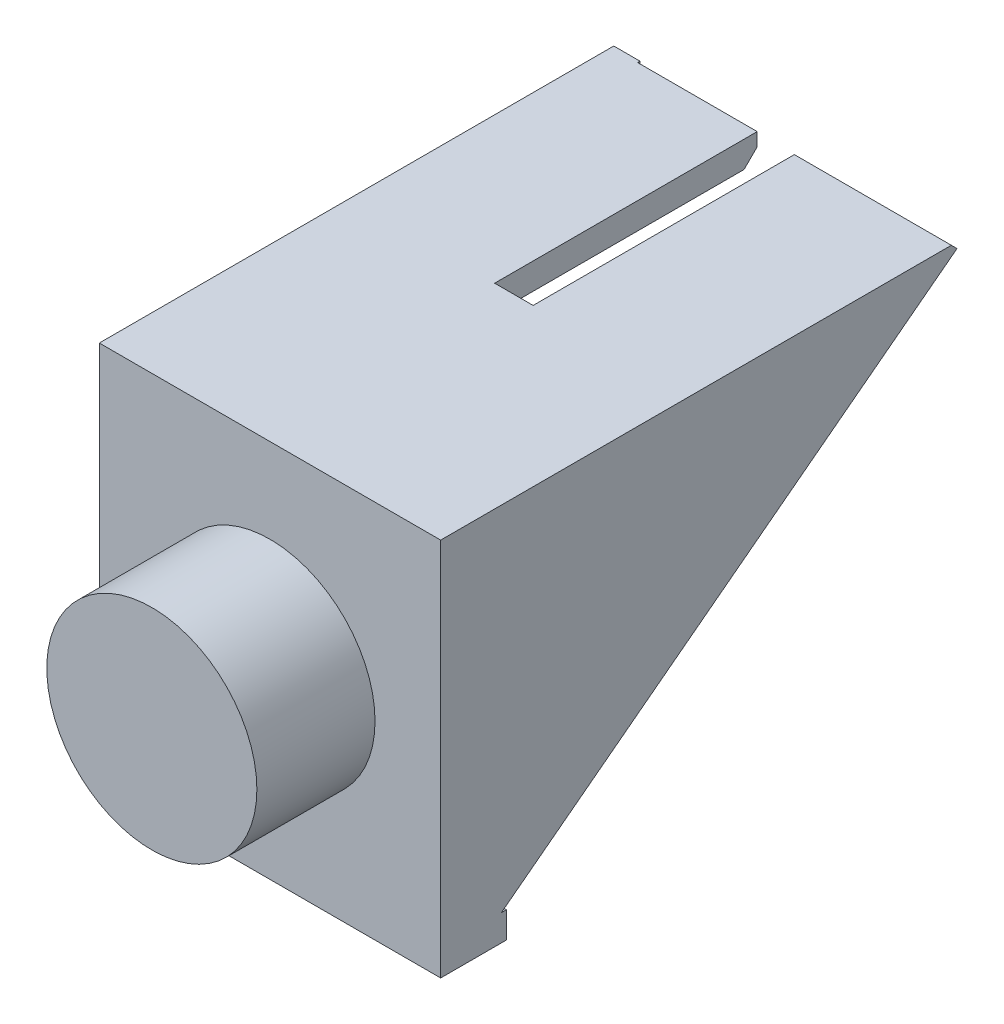
ISO-10303-21;
HEADER;
FILE_DESCRIPTION(('STEP AP214'),'2;1');
FILE_NAME('part.step','',(''),(''),'','','');
FILE_SCHEMA(('AUTOMOTIVE_DESIGN { 1 0 10303 214 1 1 1 1 }'));
ENDSEC;
DATA;
#1=APPLICATION_CONTEXT('core data for automotive mechanical design processes');
#2=APPLICATION_PROTOCOL_DEFINITION('international standard','automotive_design',2000,#1);
#3=PRODUCT_CONTEXT('',#1,'mechanical');
#4=PRODUCT('Part','Part','',(#3));
#5=PRODUCT_RELATED_PRODUCT_CATEGORY('part','',(#4));
#6=PRODUCT_DEFINITION_FORMATION('','',#4);
#7=PRODUCT_DEFINITION_CONTEXT('part definition',#1,'design');
#8=PRODUCT_DEFINITION('design','',#6,#7);
#9=PRODUCT_DEFINITION_SHAPE('','',#8);
#10=(LENGTH_UNIT() NAMED_UNIT(*) SI_UNIT(.MILLI.,.METRE.));
#11=(NAMED_UNIT(*) PLANE_ANGLE_UNIT() SI_UNIT($,.RADIAN.));
#12=(NAMED_UNIT(*) SI_UNIT($,.STERADIAN.) SOLID_ANGLE_UNIT());
#13=UNCERTAINTY_MEASURE_WITH_UNIT(LENGTH_MEASURE(1.E-05),#10,'distance_accuracy_value','');
#14=(GEOMETRIC_REPRESENTATION_CONTEXT(3) GLOBAL_UNCERTAINTY_ASSIGNED_CONTEXT((#13)) GLOBAL_UNIT_ASSIGNED_CONTEXT((#10,
#11,#12)) REPRESENTATION_CONTEXT('',''));
#15=CARTESIAN_POINT('',(0.,0.,0.));
#16=DIRECTION('',(0.,0.,1.));
#17=DIRECTION('',(1.,0.,0.));
#18=AXIS2_PLACEMENT_3D('',#15,#16,#17);
#19=CARTESIAN_POINT('',(0.,0.,-17.));
#20=DIRECTION('',(0.,0.,1.));
#21=DIRECTION('',(1.,0.,0.));
#22=AXIS2_PLACEMENT_3D('',#19,#20,#21);
#23=PLANE('',#22);
#24=DIRECTION('',(0.,1.,0.));
#25=VECTOR('',#24,1.);
#26=CARTESIAN_POINT('',(12.041243368597,23.6,-17.));
#27=LINE('',#26,#25);
#28=CARTESIAN_POINT('',(12.041243368597,21.6,-17.));
#29=VERTEX_POINT('',#28);
#30=CARTESIAN_POINT('',(12.041243368597,23.6,-17.));
#31=VERTEX_POINT('',#30);
#32=EDGE_CURVE('E219',#29,#31,#27,.T.);
#33=ORIENTED_EDGE('',*,*,#32,.F.);
#34=DIRECTION('',(-1.,0.,0.));
#35=VECTOR('',#34,1.);
#36=CARTESIAN_POINT('',(0.,21.6,-17.));
#37=LINE('',#36,#35);
#38=CARTESIAN_POINT('',(9.10916541804306,21.6,-17.));
#39=VERTEX_POINT('',#38);
#40=EDGE_CURVE('E227',#29,#39,#37,.T.);
#41=ORIENTED_EDGE('',*,*,#40,.T.);
#42=DIRECTION('',(0.,-1.,0.));
#43=VECTOR('',#42,1.);
#44=CARTESIAN_POINT('',(9.10916541804306,23.6,-17.));
#45=LINE('',#44,#43);
#46=CARTESIAN_POINT('',(9.10916541804306,23.6,-17.));
#47=VERTEX_POINT('',#46);
#48=EDGE_CURVE('E243',#47,#39,#45,.T.);
#49=ORIENTED_EDGE('',*,*,#48,.F.);
#50=DIRECTION('',(1.,0.,0.));
#51=VECTOR('',#50,1.);
#52=CARTESIAN_POINT('',(0.,23.6,-17.));
#53=LINE('',#52,#51);
#54=EDGE_CURVE('E235',#47,#31,#53,.T.);
#55=ORIENTED_EDGE('',*,*,#54,.T.);
#56=EDGE_LOOP('',(#33,#41,#49,#55));
#57=FACE_BOUND('',#56,.T.);
#58=ADVANCED_FACE('F45',(#57),#23,.F.);
#59=CARTESIAN_POINT('',(22.,0.,0.));
#60=DIRECTION('',(-1.,0.,0.));
#61=DIRECTION('',(0.,-1.,0.));
#62=AXIS2_PLACEMENT_3D('',#59,#60,#61);
#63=PLANE('',#62);
#64=DIRECTION('',(0.,0.,1.));
#65=VECTOR('',#64,1.);
#66=CARTESIAN_POINT('',(22.,21.6,-17.));
#67=LINE('',#66,#65);
#68=CARTESIAN_POINT('',(22.,21.6,-35.2720852881629));
#69=VERTEX_POINT('',#68);
#70=CARTESIAN_POINT('',(22.,21.6,0.));
#71=VERTEX_POINT('',#70);
#72=EDGE_CURVE('E302',#69,#71,#67,.T.);
#73=ORIENTED_EDGE('',*,*,#72,.F.);
#74=DIRECTION('',(0.,0.606197447126442,-0.795314186405212));
#75=VECTOR('',#74,1.);
#76=CARTESIAN_POINT('',(22.,23.6,-37.8960296487841));
#77=LINE('',#76,#75);
#78=CARTESIAN_POINT('',(22.,-3.28478141343808,-2.62394436062127));
#79=VERTEX_POINT('',#78);
#80=EDGE_CURVE('E345',#79,#69,#77,.T.);
#81=ORIENTED_EDGE('',*,*,#80,.F.);
#82=DIRECTION('',(0.,0.,1.));
#83=VECTOR('',#82,1.);
#84=CARTESIAN_POINT('',(22.0000000000001,-3.28478141343808,0.));
#85=LINE('',#84,#83);
#86=CARTESIAN_POINT('',(22.0000000000001,-3.28478141343808,0.));
#87=VERTEX_POINT('',#86);
#88=EDGE_CURVE('E293',#79,#87,#85,.T.);
#89=ORIENTED_EDGE('',*,*,#88,.T.);
#90=DIRECTION('',(0.,-1.,0.));
#91=VECTOR('',#90,1.);
#92=CARTESIAN_POINT('',(22.0000000000001,-5.28478141343809,0.));
#93=LINE('',#92,#91);
#94=EDGE_CURVE('E341',#71,#87,#93,.T.);
#95=ORIENTED_EDGE('',*,*,#94,.F.);
#96=EDGE_LOOP('',(#73,#81,#89,#95));
#97=FACE_BOUND('',#96,.T.);
#98=ADVANCED_FACE('F478',(#97),#63,.T.);
#99=CARTESIAN_POINT('',(0.,10.2,-13.454047634165));
#100=DIRECTION('',(-1.,0.,0.));
#101=DIRECTION('',(0.,0.,1.));
#102=AXIS2_PLACEMENT_3D('',#99,#100,#101);
#103=PLANE('',#102);
#104=DIRECTION('',(0.,-0.606197447126442,0.795314186405212));
#105=VECTOR('',#104,1.);
#106=CARTESIAN_POINT('',(0.,19.3047005383792,-32.2607162490345));
#107=LINE('',#106,#105);
#108=CARTESIAN_POINT('',(0.,21.6,-35.2720852881629));
#109=VERTEX_POINT('',#108);
#110=CARTESIAN_POINT('',(0.,19.3047005383792,-32.2607162490345));
#111=VERTEX_POINT('',#110);
#112=EDGE_CURVE('E309',#109,#111,#107,.T.);
#113=ORIENTED_EDGE('',*,*,#112,.F.);
#114=DIRECTION('',(0.,0.,1.));
#115=VECTOR('',#114,1.);
#116=CARTESIAN_POINT('',(0.,21.6,-17.));
#117=LINE('',#116,#115);
#118=CARTESIAN_POINT('',(0.,21.6,0.));
#119=VERTEX_POINT('',#118);
#120=EDGE_CURVE('E234',#109,#119,#117,.T.);
#121=ORIENTED_EDGE('',*,*,#120,.T.);
#122=DIRECTION('',(0.,1.,0.));
#123=VECTOR('',#122,1.);
#124=CARTESIAN_POINT('',(0.,23.6,0.));
#125=LINE('',#124,#123);
#126=CARTESIAN_POINT('',(0.,-3.28478141343808,0.));
#127=VERTEX_POINT('',#126);
#128=EDGE_CURVE('E318',#127,#119,#125,.T.);
#129=ORIENTED_EDGE('',*,*,#128,.F.);
#130=DIRECTION('',(0.,0.,1.));
#131=VECTOR('',#130,1.);
#132=CARTESIAN_POINT('',(0.,-3.28478141343808,-13.454047634165));
#133=LINE('',#132,#131);
#134=CARTESIAN_POINT('',(0.,-3.28478141343808,-2.62394436062125));
#135=VERTEX_POINT('',#134);
#136=EDGE_CURVE('E288',#135,#127,#133,.T.);
#137=ORIENTED_EDGE('',*,*,#136,.F.);
#138=DIRECTION('',(0.,-0.606197447126442,0.795314186405212));
#139=VECTOR('',#138,1.);
#140=CARTESIAN_POINT('',(0.,-5.28478141343808,0.));
#141=LINE('',#140,#139);
#142=CARTESIAN_POINT('',(0.,1.98230595362597,-9.53421645747481));
#143=VERTEX_POINT('',#142);
#144=EDGE_CURVE('E315',#143,#135,#141,.T.);
#145=ORIENTED_EDGE('',*,*,#144,.F.);
#146=CARTESIAN_POINT('',(0.,10.2,-13.454047634165));
#147=DIRECTION('',(1.,0.,0.));
#148=DIRECTION('',(0.,0.,1.));
#149=AXIS2_PLACEMENT_3D('',#146,#147,#148);
#150=CIRCLE('',#149,9.10470053837925);
#151=CARTESIAN_POINT('',(0.,19.3047005383792,-13.454047634165));
#152=VERTEX_POINT('',#151);
#153=EDGE_CURVE('E312',#152,#143,#150,.T.);
#154=ORIENTED_EDGE('',*,*,#153,.F.);
#155=DIRECTION('',(0.,0.,1.));
#156=VECTOR('',#155,1.);
#157=CARTESIAN_POINT('',(0.,19.3047005383792,-13.454047634165));
#158=LINE('',#157,#156);
#159=EDGE_CURVE('E308',#111,#152,#158,.T.);
#160=ORIENTED_EDGE('',*,*,#159,.F.);
#161=EDGE_LOOP('',(#113,#121,#129,#137,#145,#154,#160));
#162=FACE_BOUND('',#161,.T.);
#163=ADVANCED_FACE('F452',(#162),#103,.F.);
#164=CARTESIAN_POINT('',(0.,22.9938025528736,-37.1007154623789));
#165=VERTEX_POINT('',#164);
#166=CARTESIAN_POINT('',(0.,22.9170360909848,-37.));
#167=VERTEX_POINT('',#166);
#168=EDGE_CURVE('E306',#165,#167,#107,.T.);
#169=ORIENTED_EDGE('',*,*,#168,.F.);
#170=DIRECTION('',(0.,0.991018379982067,-0.133725728779913));
#171=VECTOR('',#170,1.);
#172=CARTESIAN_POINT('',(0.,23.6,-37.1825143442553));
#173=LINE('',#172,#171);
#174=CARTESIAN_POINT('',(0.,23.6,-37.1825143442553));
#175=VERTEX_POINT('',#174);
#176=EDGE_CURVE('E398',#165,#175,#173,.T.);
#177=ORIENTED_EDGE('',*,*,#176,.T.);
#178=DIRECTION('',(0.,0.,-1.));
#179=VECTOR('',#178,1.);
#180=CARTESIAN_POINT('',(0.,23.6,-37.8960296487841));
#181=LINE('',#180,#179);
#182=CARTESIAN_POINT('',(0.,23.6,-37.));
#183=VERTEX_POINT('',#182);
#184=EDGE_CURVE('E320',#183,#175,#181,.T.);
#185=ORIENTED_EDGE('',*,*,#184,.F.);
#186=DIRECTION('',(0.,1.,0.));
#187=VECTOR('',#186,1.);
#188=CARTESIAN_POINT('',(0.,23.6,-37.));
#189=LINE('',#188,#187);
#190=EDGE_CURVE('E255',#167,#183,#189,.T.);
#191=ORIENTED_EDGE('',*,*,#190,.F.);
#192=EDGE_LOOP('',(#169,#177,#185,#191));
#193=FACE_BOUND('',#192,.T.);
#194=ADVANCED_FACE('F528',(#193),#103,.F.);
#195=CARTESIAN_POINT('',(0.,0.,0.));
#196=DIRECTION('',(0.,0.,1.));
#197=DIRECTION('',(1.,0.,0.));
#198=AXIS2_PLACEMENT_3D('',#195,#196,#197);
#199=PLANE('',#198);
#200=DIRECTION('',(1.,0.,0.));
#201=VECTOR('',#200,1.);
#202=CARTESIAN_POINT('',(24.0000000000001,-3.28478141343808,0.));
#203=LINE('',#202,#201);
#204=EDGE_CURVE('E270',#127,#87,#203,.T.);
#205=ORIENTED_EDGE('',*,*,#204,.F.);
#206=ORIENTED_EDGE('',*,*,#128,.T.);
#207=DIRECTION('',(-1.,0.,0.));
#208=VECTOR('',#207,1.);
#209=CARTESIAN_POINT('',(0.,21.6,0.));
#210=LINE('',#209,#208);
#211=EDGE_CURVE('E296',#71,#119,#210,.T.);
#212=ORIENTED_EDGE('',*,*,#211,.F.);
#213=ORIENTED_EDGE('',*,*,#94,.T.);
#214=EDGE_LOOP('',(#205,#206,#212,#213));
#215=FACE_BOUND('',#214,.T.);
#216=ADVANCED_FACE('F476',(#215),#199,.F.);
#217=DIRECTION('',(0.,-1.,0.));
#218=VECTOR('',#217,1.);
#219=CARTESIAN_POINT('',(22.,23.6,-37.));
#220=LINE('',#219,#218);
#221=CARTESIAN_POINT('',(22.,23.4960296487841,-37.));
#222=VERTEX_POINT('',#221);
#223=CARTESIAN_POINT('',(22.,22.9170360909848,-37.));
#224=VERTEX_POINT('',#223);
#225=EDGE_CURVE('E240',#222,#224,#220,.T.);
#226=ORIENTED_EDGE('',*,*,#225,.F.);
#227=DIRECTION('',(0.,-0.707106781186558,-0.707106781186537));
#228=VECTOR('',#227,1.);
#229=CARTESIAN_POINT('',(22.,30.2480148243917,-30.2480148243926));
#230=LINE('',#229,#228);
#231=CARTESIAN_POINT('',(22.,23.167468843909,-37.3285608048751));
#232=VERTEX_POINT('',#231);
#233=EDGE_CURVE('E50',#222,#232,#230,.T.);
#234=ORIENTED_EDGE('',*,*,#233,.T.);
#235=EDGE_CURVE('E344',#224,#232,#77,.T.);
#236=ORIENTED_EDGE('',*,*,#235,.F.);
#237=EDGE_LOOP('',(#226,#234,#236));
#238=FACE_BOUND('',#237,.T.);
#239=ADVANCED_FACE('F409',(#238),#63,.T.);
#240=CARTESIAN_POINT('',(22.,23.6,-37.8960296487841));
#241=DIRECTION('',(0.,-0.795314186405212,-0.606197447126442));
#242=DIRECTION('',(0.,0.606197447126442,-0.795314186405212));
#243=AXIS2_PLACEMENT_3D('',#240,#241,#242);
#244=PLANE('',#243);
#245=ORIENTED_EDGE('',*,*,#235,.T.);
#246=DIRECTION('',(1.,0.,0.));
#247=VECTOR('',#246,1.);
#248=CARTESIAN_POINT('',(24.,23.167468843909,-37.3285608048751));
#249=LINE('',#248,#247);
#250=CARTESIAN_POINT('',(24.,23.167468843909,-37.3285608048751));
#251=VERTEX_POINT('',#250);
#252=EDGE_CURVE('E400',#232,#251,#249,.T.);
#253=ORIENTED_EDGE('',*,*,#252,.T.);
#254=DIRECTION('',(0.,0.606197447126442,-0.795314186405212));
#255=VECTOR('',#254,1.);
#256=CARTESIAN_POINT('',(24.,23.6,-37.8960296487841));
#257=LINE('',#256,#255);
#258=CARTESIAN_POINT('',(24.0000000000001,-3.28478141343808,-2.62394436062125));
#259=VERTEX_POINT('',#258);
#260=EDGE_CURVE('E336',#259,#251,#257,.T.);
#261=ORIENTED_EDGE('',*,*,#260,.F.);
#262=DIRECTION('',(-1.,0.,0.));
#263=VECTOR('',#262,1.);
#264=CARTESIAN_POINT('',(21.9999999999999,-3.28478141343808,-2.62394436062127));
#265=LINE('',#264,#263);
#266=EDGE_CURVE('E290',#259,#79,#265,.T.);
#267=ORIENTED_EDGE('',*,*,#266,.T.);
#268=ORIENTED_EDGE('',*,*,#80,.T.);
#269=DIRECTION('',(0.,0.606197447126442,-0.795314186405212));
#270=VECTOR('',#269,1.);
#271=CARTESIAN_POINT('',(22.,23.6,-37.8960296487841));
#272=LINE('',#271,#270);
#273=EDGE_CURVE('E239',#69,#224,#272,.T.);
#274=ORIENTED_EDGE('',*,*,#273,.T.);
#275=EDGE_LOOP('',(#245,#253,#261,#267,#268,#274));
#276=FACE_BOUND('',#275,.T.);
#277=ADVANCED_FACE('F413',(#276),#244,.T.);
#278=CARTESIAN_POINT('',(0.,-5.28478141343808,0.));
#279=DIRECTION('',(0.,-0.795314186405212,-0.606197447126443));
#280=DIRECTION('',(0.,0.606197447126443,-0.795314186405212));
#281=AXIS2_PLACEMENT_3D('',#278,#279,#280);
#282=PLANE('',#281);
#283=ORIENTED_EDGE('',*,*,#144,.T.);
#284=DIRECTION('',(-1.,0.,0.));
#285=VECTOR('',#284,1.);
#286=CARTESIAN_POINT('',(0.,-3.28478141343808,-2.62394436062125));
#287=LINE('',#286,#285);
#288=CARTESIAN_POINT('',(-2.,-3.28478141343808,-2.62394436062125));
#289=VERTEX_POINT('',#288);
#290=EDGE_CURVE('E369',#135,#289,#287,.T.);
#291=ORIENTED_EDGE('',*,*,#290,.T.);
#292=DIRECTION('',(0.,-0.606197447126442,0.795314186405212));
#293=VECTOR('',#292,1.);
#294=CARTESIAN_POINT('',(-2.,-5.28478141343808,0.));
#295=LINE('',#294,#293);
#296=CARTESIAN_POINT('',(-2.,1.98230595362597,-9.53421645747481));
#297=VERTEX_POINT('',#296);
#298=EDGE_CURVE('E331',#297,#289,#295,.T.);
#299=ORIENTED_EDGE('',*,*,#298,.F.);
#300=DIRECTION('',(-1.,0.,0.));
#301=VECTOR('',#300,1.);
#302=CARTESIAN_POINT('',(0.,1.98230595362597,-9.53421645747481));
#303=LINE('',#302,#301);
#304=EDGE_CURVE('E334',#143,#297,#303,.T.);
#305=ORIENTED_EDGE('',*,*,#304,.F.);
#306=EDGE_LOOP('',(#283,#291,#299,#305));
#307=FACE_BOUND('',#306,.T.);
#308=ADVANCED_FACE('F447',(#307),#282,.T.);
#309=CARTESIAN_POINT('',(24.,23.6,2.));
#310=DIRECTION('',(0.,-1.,0.));
#311=DIRECTION('',(0.,0.,-1.));
#312=AXIS2_PLACEMENT_3D('',#309,#310,#311);
#313=PLANE('',#312);
#314=ORIENTED_EDGE('',*,*,#184,.T.);
#315=DIRECTION('',(-1.,0.,0.));
#316=VECTOR('',#315,1.);
#317=CARTESIAN_POINT('',(-2.,23.6,-37.1825143442553));
#318=LINE('',#317,#316);
#319=CARTESIAN_POINT('',(-2.,23.6,-37.1825143442553));
#320=VERTEX_POINT('',#319);
#321=EDGE_CURVE('E391',#175,#320,#318,.T.);
#322=ORIENTED_EDGE('',*,*,#321,.T.);
#323=DIRECTION('',(0.,0.,-1.));
#324=VECTOR('',#323,1.);
#325=CARTESIAN_POINT('',(-2.,23.6,2.));
#326=LINE('',#325,#324);
#327=CARTESIAN_POINT('',(-2.,23.6,2.));
#328=VERTEX_POINT('',#327);
#329=EDGE_CURVE('E366',#328,#320,#326,.T.);
#330=ORIENTED_EDGE('',*,*,#329,.F.);
#331=DIRECTION('',(-1.,0.,0.));
#332=VECTOR('',#331,1.);
#333=CARTESIAN_POINT('',(24.,23.6,2.));
#334=LINE('',#333,#332);
#335=CARTESIAN_POINT('',(24.,23.6,2.));
#336=VERTEX_POINT('',#335);
#337=EDGE_CURVE('E348',#336,#328,#334,.T.);
#338=ORIENTED_EDGE('',*,*,#337,.F.);
#339=DIRECTION('',(0.,0.,-1.));
#340=VECTOR('',#339,1.);
#341=CARTESIAN_POINT('',(24.,23.6,2.));
#342=LINE('',#341,#340);
#343=CARTESIAN_POINT('',(24.,23.6,-36.8960296487841));
#344=VERTEX_POINT('',#343);
#345=EDGE_CURVE('E359',#336,#344,#342,.T.);
#346=ORIENTED_EDGE('',*,*,#345,.T.);
#347=DIRECTION('',(-1.,0.,0.));
#348=VECTOR('',#347,1.);
#349=CARTESIAN_POINT('',(22.,23.6,-36.8960296487841));
#350=LINE('',#349,#348);
#351=CARTESIAN_POINT('',(12.041243368597,23.6,-36.8960296487841));
#352=VERTEX_POINT('',#351);
#353=EDGE_CURVE('E389',#344,#352,#350,.T.);
#354=ORIENTED_EDGE('',*,*,#353,.T.);
#355=DIRECTION('',(0.,0.,1.));
#356=VECTOR('',#355,1.);
#357=CARTESIAN_POINT('',(12.041243368597,23.6,-37.));
#358=LINE('',#357,#356);
#359=EDGE_CURVE('E223',#352,#31,#358,.T.);
#360=ORIENTED_EDGE('',*,*,#359,.T.);
#361=ORIENTED_EDGE('',*,*,#54,.F.);
#362=DIRECTION('',(0.,0.,1.));
#363=VECTOR('',#362,1.);
#364=CARTESIAN_POINT('',(9.10916541804306,23.6,-37.));
#365=LINE('',#364,#363);
#366=CARTESIAN_POINT('',(9.10916541804306,23.6,-37.));
#367=VERTEX_POINT('',#366);
#368=EDGE_CURVE('E264',#367,#47,#365,.T.);
#369=ORIENTED_EDGE('',*,*,#368,.F.);
#370=DIRECTION('',(1.,0.,0.));
#371=VECTOR('',#370,1.);
#372=CARTESIAN_POINT('',(0.,23.6,-37.));
#373=LINE('',#372,#371);
#374=EDGE_CURVE('E254',#183,#367,#373,.T.);
#375=ORIENTED_EDGE('',*,*,#374,.F.);
#376=EDGE_LOOP('',(#314,#322,#330,#338,#346,#354,#360,#361,#369,#375));
#377=FACE_BOUND('',#376,.T.);
#378=ADVANCED_FACE('F424',(#377),#313,.F.);
#379=CARTESIAN_POINT('',(-2.,20.4,2.));
#380=DIRECTION('',(1.,0.,0.));
#381=DIRECTION('',(0.,0.,-1.));
#382=AXIS2_PLACEMENT_3D('',#379,#380,#381);
#383=PLANE('',#382);
#384=ORIENTED_EDGE('',*,*,#329,.T.);
#385=DIRECTION('',(0.,-0.991018379982067,0.133725728779913));
#386=VECTOR('',#385,1.);
#387=CARTESIAN_POINT('',(-2.,23.6,-37.1825143442553));
#388=LINE('',#387,#386);
#389=CARTESIAN_POINT('',(-2.,22.9938025528736,-37.1007154623789));
#390=VERTEX_POINT('',#389);
#391=EDGE_CURVE('E394',#320,#390,#388,.T.);
#392=ORIENTED_EDGE('',*,*,#391,.T.);
#393=DIRECTION('',(0.,-0.606197447126442,0.795314186405212));
#394=VECTOR('',#393,1.);
#395=CARTESIAN_POINT('',(-2.,19.3047005383792,-32.2607162490345));
#396=LINE('',#395,#394);
#397=CARTESIAN_POINT('',(-2.,19.3047005383792,-32.2607162490345));
#398=VERTEX_POINT('',#397);
#399=EDGE_CURVE('E305',#390,#398,#396,.T.);
#400=ORIENTED_EDGE('',*,*,#399,.T.);
#401=DIRECTION('',(0.,0.,1.));
#402=VECTOR('',#401,1.);
#403=CARTESIAN_POINT('',(-2.,19.3047005383792,-13.454047634165));
#404=LINE('',#403,#402);
#405=CARTESIAN_POINT('',(-2.,19.3047005383792,-13.454047634165));
#406=VERTEX_POINT('',#405);
#407=EDGE_CURVE('E325',#398,#406,#404,.T.);
#408=ORIENTED_EDGE('',*,*,#407,.T.);
#409=CARTESIAN_POINT('',(-2.,10.2,-13.454047634165));
#410=DIRECTION('',(1.,0.,0.));
#411=DIRECTION('',(0.,0.,1.));
#412=AXIS2_PLACEMENT_3D('',#409,#410,#411);
#413=CIRCLE('',#412,9.10470053837925);
#414=EDGE_CURVE('E328',#406,#297,#413,.T.);
#415=ORIENTED_EDGE('',*,*,#414,.T.);
#416=ORIENTED_EDGE('',*,*,#298,.T.);
#417=DIRECTION('',(0.,0.,1.));
#418=VECTOR('',#417,1.);
#419=CARTESIAN_POINT('',(-2.,-3.28478141343808,-3.));
#420=LINE('',#419,#418);
#421=CARTESIAN_POINT('',(-2.,-3.28478141343808,-3.));
#422=VERTEX_POINT('',#421);
#423=EDGE_CURVE('E286',#422,#289,#420,.T.);
#424=ORIENTED_EDGE('',*,*,#423,.F.);
#425=DIRECTION('',(0.,1.,0.));
#426=VECTOR('',#425,1.);
#427=CARTESIAN_POINT('',(-2.,-5.28478141343808,-3.));
#428=LINE('',#427,#426);
#429=CARTESIAN_POINT('',(-2.,-5.28478141343808,-3.));
#430=VERTEX_POINT('',#429);
#431=EDGE_CURVE('E271',#430,#422,#428,.T.);
#432=ORIENTED_EDGE('',*,*,#431,.F.);
#433=DIRECTION('',(0.,0.,-1.));
#434=VECTOR('',#433,1.);
#435=CARTESIAN_POINT('',(-2.,-5.28478141343808,2.));
#436=LINE('',#435,#434);
#437=CARTESIAN_POINT('',(-2.,-5.28478141343808,2.));
#438=VERTEX_POINT('',#437);
#439=EDGE_CURVE('E364',#438,#430,#436,.T.);
#440=ORIENTED_EDGE('',*,*,#439,.F.);
#441=DIRECTION('',(0.,-1.,0.));
#442=VECTOR('',#441,1.);
#443=CARTESIAN_POINT('',(-2.,23.6,2.));
#444=LINE('',#443,#442);
#445=EDGE_CURVE('E353',#328,#438,#444,.T.);
#446=ORIENTED_EDGE('',*,*,#445,.F.);
#447=EDGE_LOOP('',(#384,#392,#400,#408,#415,#416,#424,#432,#440,#446));
#448=FACE_BOUND('',#447,.T.);
#449=ADVANCED_FACE('F440',(#448),#383,.F.);
#450=CARTESIAN_POINT('',(-2.,-5.28478141343808,2.));
#451=DIRECTION('',(0.,1.,0.));
#452=DIRECTION('',(0.,0.,1.));
#453=AXIS2_PLACEMENT_3D('',#450,#451,#452);
#454=PLANE('',#453);
#455=DIRECTION('',(-1.,0.,0.));
#456=VECTOR('',#455,1.);
#457=CARTESIAN_POINT('',(24.0000000000001,-5.28478141343808,-3.));
#458=LINE('',#457,#456);
#459=CARTESIAN_POINT('',(24.0000000000001,-5.28478141343808,-3.));
#460=VERTEX_POINT('',#459);
#461=EDGE_CURVE('E279',#460,#430,#458,.T.);
#462=ORIENTED_EDGE('',*,*,#461,.F.);
#463=DIRECTION('',(0.,0.,-1.));
#464=VECTOR('',#463,1.);
#465=CARTESIAN_POINT('',(24.,-5.28478141343808,2.));
#466=LINE('',#465,#464);
#467=CARTESIAN_POINT('',(24.,-5.28478141343808,2.));
#468=VERTEX_POINT('',#467);
#469=EDGE_CURVE('E362',#468,#460,#466,.T.);
#470=ORIENTED_EDGE('',*,*,#469,.F.);
#471=DIRECTION('',(1.,0.,0.));
#472=VECTOR('',#471,1.);
#473=CARTESIAN_POINT('',(-2.,-5.28478141343808,2.));
#474=LINE('',#473,#472);
#475=EDGE_CURVE('E355',#438,#468,#474,.T.);
#476=ORIENTED_EDGE('',*,*,#475,.F.);
#477=ORIENTED_EDGE('',*,*,#439,.T.);
#478=EDGE_LOOP('',(#462,#470,#476,#477));
#479=FACE_BOUND('',#478,.T.);
#480=ADVANCED_FACE('F438',(#479),#454,.F.);
#481=CARTESIAN_POINT('',(24.,20.4,2.));
#482=DIRECTION('',(-1.,0.,0.));
#483=DIRECTION('',(0.,-1.,0.));
#484=AXIS2_PLACEMENT_3D('',#481,#482,#483);
#485=PLANE('',#484);
#486=ORIENTED_EDGE('',*,*,#260,.T.);
#487=DIRECTION('',(0.,0.707106781186558,0.707106781186537));
#488=VECTOR('',#487,1.);
#489=CARTESIAN_POINT('',(24.,23.167468843909,-37.3285608048751));
#490=LINE('',#489,#488);
#491=EDGE_CURVE('E403',#251,#344,#490,.T.);
#492=ORIENTED_EDGE('',*,*,#491,.T.);
#493=ORIENTED_EDGE('',*,*,#345,.F.);
#494=DIRECTION('',(0.,1.,0.));
#495=VECTOR('',#494,1.);
#496=CARTESIAN_POINT('',(24.,-5.28478141343808,2.));
#497=LINE('',#496,#495);
#498=EDGE_CURVE('E357',#468,#336,#497,.T.);
#499=ORIENTED_EDGE('',*,*,#498,.F.);
#500=ORIENTED_EDGE('',*,*,#469,.T.);
#501=DIRECTION('',(0.,-1.,0.));
#502=VECTOR('',#501,1.);
#503=CARTESIAN_POINT('',(24.0000000000001,-5.28478141343808,-3.));
#504=LINE('',#503,#502);
#505=CARTESIAN_POINT('',(24.0000000000001,-3.28478141343808,-3.));
#506=VERTEX_POINT('',#505);
#507=EDGE_CURVE('E276',#506,#460,#504,.T.);
#508=ORIENTED_EDGE('',*,*,#507,.F.);
#509=DIRECTION('',(0.,0.,1.));
#510=VECTOR('',#509,1.);
#511=CARTESIAN_POINT('',(24.0000000000001,-3.28478141343808,-3.));
#512=LINE('',#511,#510);
#513=EDGE_CURVE('E282',#506,#259,#512,.T.);
#514=ORIENTED_EDGE('',*,*,#513,.T.);
#515=EDGE_LOOP('',(#486,#492,#493,#499,#500,#508,#514));
#516=FACE_BOUND('',#515,.T.);
#517=ADVANCED_FACE('F420',(#516),#485,.F.);
#518=CARTESIAN_POINT('',(0.,0.,2.));
#519=DIRECTION('',(0.,0.,1.));
#520=DIRECTION('',(1.,0.,0.));
#521=AXIS2_PLACEMENT_3D('',#518,#519,#520);
#522=PLANE('',#521);
#523=CARTESIAN_POINT('',(11.,9.15760929328096,2.));
#524=DIRECTION('',(0.,0.,1.));
#525=DIRECTION('',(1.,0.,0.));
#526=AXIS2_PLACEMENT_3D('',#523,#524,#525);
#527=CIRCLE('',#526,8.);
#528=CARTESIAN_POINT('',(19.,9.15760929328096,2.));
#529=VERTEX_POINT('',#528);
#530=EDGE_CURVE('E11',#529,#529,#527,.T.);
#531=ORIENTED_EDGE('',*,*,#530,.F.);
#532=EDGE_LOOP('',(#531));
#533=FACE_BOUND('',#532,.T.);
#534=ORIENTED_EDGE('',*,*,#337,.T.);
#535=ORIENTED_EDGE('',*,*,#445,.T.);
#536=ORIENTED_EDGE('',*,*,#475,.T.);
#537=ORIENTED_EDGE('',*,*,#498,.T.);
#538=EDGE_LOOP('',(#534,#535,#536,#537));
#539=FACE_BOUND('',#538,.T.);
#540=ADVANCED_FACE('F427',(#533,#539),#522,.T.);
#541=CARTESIAN_POINT('',(0.,19.3047005383792,-32.2607162490345));
#542=DIRECTION('',(0.,-0.795314186405212,-0.606197447126443));
#543=DIRECTION('',(0.,0.606197447126443,-0.795314186405212));
#544=AXIS2_PLACEMENT_3D('',#541,#542,#543);
#545=PLANE('',#544);
#546=ORIENTED_EDGE('',*,*,#399,.F.);
#547=DIRECTION('',(1.,0.,0.));
#548=VECTOR('',#547,1.);
#549=CARTESIAN_POINT('',(0.,22.9938025528736,-37.1007154623789));
#550=LINE('',#549,#548);
#551=EDGE_CURVE('E396',#390,#165,#550,.T.);
#552=ORIENTED_EDGE('',*,*,#551,.T.);
#553=ORIENTED_EDGE('',*,*,#168,.T.);
#554=DIRECTION('',(0.,-0.606197447126443,0.795314186405212));
#555=VECTOR('',#554,1.);
#556=CARTESIAN_POINT('',(0.,19.3047005383792,-32.2607162490345));
#557=LINE('',#556,#555);
#558=EDGE_CURVE('E267',#167,#109,#557,.T.);
#559=ORIENTED_EDGE('',*,*,#558,.T.);
#560=ORIENTED_EDGE('',*,*,#112,.T.);
#561=DIRECTION('',(-1.,0.,0.));
#562=VECTOR('',#561,1.);
#563=CARTESIAN_POINT('',(0.,19.3047005383792,-32.2607162490345));
#564=LINE('',#563,#562);
#565=EDGE_CURVE('E323',#111,#398,#564,.T.);
#566=ORIENTED_EDGE('',*,*,#565,.T.);
#567=EDGE_LOOP('',(#546,#552,#553,#559,#560,#566));
#568=FACE_BOUND('',#567,.T.);
#569=ADVANCED_FACE('F466',(#568),#545,.T.);
#570=CARTESIAN_POINT('',(0.,10.2,-13.454047634165));
#571=DIRECTION('',(-1.,0.,0.));
#572=DIRECTION('',(0.,0.,1.));
#573=AXIS2_PLACEMENT_3D('',#570,#571,#572);
#574=CYLINDRICAL_SURFACE('',#573,9.10470053837925);
#575=ORIENTED_EDGE('',*,*,#414,.F.);
#576=DIRECTION('',(-1.,0.,0.));
#577=VECTOR('',#576,1.);
#578=CARTESIAN_POINT('',(0.,19.3047005383792,-13.454047634165));
#579=LINE('',#578,#577);
#580=EDGE_CURVE('E337',#152,#406,#579,.T.);
#581=ORIENTED_EDGE('',*,*,#580,.F.);
#582=ORIENTED_EDGE('',*,*,#153,.T.);
#583=ORIENTED_EDGE('',*,*,#304,.T.);
#584=EDGE_LOOP('',(#575,#581,#582,#583));
#585=FACE_BOUND('',#584,.T.);
#586=ADVANCED_FACE('F457',(#585),#574,.F.);
#587=CARTESIAN_POINT('',(0.,19.3047005383792,-13.454047634165));
#588=DIRECTION('',(0.,-1.,0.));
#589=DIRECTION('',(0.,0.,-1.));
#590=AXIS2_PLACEMENT_3D('',#587,#588,#589);
#591=PLANE('',#590);
#592=ORIENTED_EDGE('',*,*,#407,.F.);
#593=ORIENTED_EDGE('',*,*,#565,.F.);
#594=ORIENTED_EDGE('',*,*,#159,.T.);
#595=ORIENTED_EDGE('',*,*,#580,.T.);
#596=EDGE_LOOP('',(#592,#593,#594,#595));
#597=FACE_BOUND('',#596,.T.);
#598=ADVANCED_FACE('F460',(#597),#591,.T.);
#599=CARTESIAN_POINT('',(0.,21.6,-17.));
#600=DIRECTION('',(0.,1.,0.));
#601=DIRECTION('',(0.,0.,1.));
#602=AXIS2_PLACEMENT_3D('',#599,#600,#601);
#603=PLANE('',#602);
#604=DIRECTION('',(0.,0.,1.));
#605=VECTOR('',#604,1.);
#606=CARTESIAN_POINT('',(0.,21.6,-37.));
#607=LINE('',#606,#605);
#608=CARTESIAN_POINT('',(0.,21.6,-36.));
#609=VERTEX_POINT('',#608);
#610=EDGE_CURVE('E260',#609,#109,#607,.T.);
#611=ORIENTED_EDGE('',*,*,#610,.F.);
#612=DIRECTION('',(1.,0.,0.));
#613=VECTOR('',#612,1.);
#614=CARTESIAN_POINT('',(0.,21.6,-36.));
#615=LINE('',#614,#613);
#616=CARTESIAN_POINT('',(9.10916541804306,21.6,-36.));
#617=VERTEX_POINT('',#616);
#618=EDGE_CURVE('E379',#609,#617,#615,.T.);
#619=ORIENTED_EDGE('',*,*,#618,.T.);
#620=DIRECTION('',(0.,0.,1.));
#621=VECTOR('',#620,1.);
#622=CARTESIAN_POINT('',(9.10916541804306,21.6,-37.));
#623=LINE('',#622,#621);
#624=EDGE_CURVE('E231',#617,#39,#623,.T.);
#625=ORIENTED_EDGE('',*,*,#624,.T.);
#626=ORIENTED_EDGE('',*,*,#40,.F.);
#627=DIRECTION('',(0.,0.,1.));
#628=VECTOR('',#627,1.);
#629=CARTESIAN_POINT('',(12.041243368597,21.6,-37.));
#630=LINE('',#629,#628);
#631=CARTESIAN_POINT('',(12.041243368597,21.6,-36.));
#632=VERTEX_POINT('',#631);
#633=EDGE_CURVE('E215',#632,#29,#630,.T.);
#634=ORIENTED_EDGE('',*,*,#633,.F.);
#635=DIRECTION('',(1.,0.,0.));
#636=VECTOR('',#635,1.);
#637=CARTESIAN_POINT('',(22.,21.6,-36.));
#638=LINE('',#637,#636);
#639=CARTESIAN_POINT('',(22.,21.6,-36.));
#640=VERTEX_POINT('',#639);
#641=EDGE_CURVE('E377',#632,#640,#638,.T.);
#642=ORIENTED_EDGE('',*,*,#641,.T.);
#643=DIRECTION('',(0.,0.,1.));
#644=VECTOR('',#643,1.);
#645=CARTESIAN_POINT('',(22.,21.6,-37.));
#646=LINE('',#645,#644);
#647=EDGE_CURVE('E224',#640,#69,#646,.T.);
#648=ORIENTED_EDGE('',*,*,#647,.T.);
#649=ORIENTED_EDGE('',*,*,#72,.T.);
#650=ORIENTED_EDGE('',*,*,#211,.T.);
#651=ORIENTED_EDGE('',*,*,#120,.F.);
#652=EDGE_LOOP('',(#611,#619,#625,#626,#634,#642,#648,#649,#650,#651));
#653=FACE_BOUND('',#652,.T.);
#654=ADVANCED_FACE('F229',(#653),#603,.F.);
#655=CARTESIAN_POINT('',(24.0000000000001,-3.28478141343808,-3.));
#656=DIRECTION('',(0.,-1.,0.));
#657=DIRECTION('',(0.,0.,-1.));
#658=AXIS2_PLACEMENT_3D('',#655,#656,#657);
#659=PLANE('',#658);
#660=ORIENTED_EDGE('',*,*,#88,.F.);
#661=ORIENTED_EDGE('',*,*,#266,.F.);
#662=ORIENTED_EDGE('',*,*,#513,.F.);
#663=DIRECTION('',(1.,0.,0.));
#664=VECTOR('',#663,1.);
#665=CARTESIAN_POINT('',(24.0000000000001,-3.28478141343808,-3.));
#666=LINE('',#665,#664);
#667=EDGE_CURVE('E274',#422,#506,#666,.T.);
#668=ORIENTED_EDGE('',*,*,#667,.F.);
#669=ORIENTED_EDGE('',*,*,#423,.T.);
#670=ORIENTED_EDGE('',*,*,#290,.F.);
#671=ORIENTED_EDGE('',*,*,#136,.T.);
#672=ORIENTED_EDGE('',*,*,#204,.T.);
#673=EDGE_LOOP('',(#660,#661,#662,#668,#669,#670,#671,#672));
#674=FACE_BOUND('',#673,.T.);
#675=ADVANCED_FACE('F444',(#674),#659,.F.);
#676=CARTESIAN_POINT('',(0.,0.,-3.));
#677=DIRECTION('',(0.,0.,1.));
#678=DIRECTION('',(1.,0.,0.));
#679=AXIS2_PLACEMENT_3D('',#676,#677,#678);
#680=PLANE('',#679);
#681=ORIENTED_EDGE('',*,*,#431,.T.);
#682=ORIENTED_EDGE('',*,*,#667,.T.);
#683=ORIENTED_EDGE('',*,*,#507,.T.);
#684=ORIENTED_EDGE('',*,*,#461,.T.);
#685=EDGE_LOOP('',(#681,#682,#683,#684));
#686=FACE_BOUND('',#685,.T.);
#687=ADVANCED_FACE('F435',(#686),#680,.F.);
#688=CARTESIAN_POINT('',(0.,23.6,-37.));
#689=DIRECTION('',(1.,0.,0.));
#690=DIRECTION('',(0.,0.,-1.));
#691=AXIS2_PLACEMENT_3D('',#688,#689,#690);
#692=PLANE('',#691);
#693=CARTESIAN_POINT('',(0.,22.6,-37.));
#694=VERTEX_POINT('',#693);
#695=EDGE_CURVE('E251',#694,#167,#189,.T.);
#696=ORIENTED_EDGE('',*,*,#695,.F.);
#697=DIRECTION('',(0.,0.707106781186548,-0.707106781186548));
#698=VECTOR('',#697,1.);
#699=CARTESIAN_POINT('',(0.,22.6,-37.));
#700=LINE('',#699,#698);
#701=EDGE_CURVE('E375',#694,#609,#700,.F.);
#702=ORIENTED_EDGE('',*,*,#701,.T.);
#703=ORIENTED_EDGE('',*,*,#610,.T.);
#704=ORIENTED_EDGE('',*,*,#558,.F.);
#705=EDGE_LOOP('',(#696,#702,#703,#704));
#706=FACE_BOUND('',#705,.T.);
#707=ADVANCED_FACE('F470',(#706),#692,.F.);
#708=CARTESIAN_POINT('',(9.10916541804306,23.6,-37.));
#709=DIRECTION('',(-1.,0.,0.));
#710=DIRECTION('',(0.,0.,1.));
#711=AXIS2_PLACEMENT_3D('',#708,#709,#710);
#712=PLANE('',#711);
#713=ORIENTED_EDGE('',*,*,#624,.F.);
#714=DIRECTION('',(0.,-0.707106781186548,0.707106781186548));
#715=VECTOR('',#714,1.);
#716=CARTESIAN_POINT('',(9.10916541804306,22.6,-37.));
#717=LINE('',#716,#715);
#718=CARTESIAN_POINT('',(9.10916541804306,22.6,-37.));
#719=VERTEX_POINT('',#718);
#720=EDGE_CURVE('E381',#617,#719,#717,.F.);
#721=ORIENTED_EDGE('',*,*,#720,.T.);
#722=DIRECTION('',(0.,-1.,0.));
#723=VECTOR('',#722,1.);
#724=CARTESIAN_POINT('',(9.10916541804306,23.6,-37.));
#725=LINE('',#724,#723);
#726=EDGE_CURVE('E257',#367,#719,#725,.T.);
#727=ORIENTED_EDGE('',*,*,#726,.F.);
#728=ORIENTED_EDGE('',*,*,#368,.T.);
#729=ORIENTED_EDGE('',*,*,#48,.T.);
#730=EDGE_LOOP('',(#713,#721,#727,#728,#729));
#731=FACE_BOUND('',#730,.T.);
#732=ADVANCED_FACE('F626',(#731),#712,.F.);
#733=CARTESIAN_POINT('',(0.,0.,-37.));
#734=DIRECTION('',(0.,0.,1.));
#735=DIRECTION('',(1.,0.,0.));
#736=AXIS2_PLACEMENT_3D('',#733,#734,#735);
#737=PLANE('',#736);
#738=ORIENTED_EDGE('',*,*,#726,.T.);
#739=DIRECTION('',(-1.,0.,0.));
#740=VECTOR('',#739,1.);
#741=CARTESIAN_POINT('',(0.,22.6,-37.));
#742=LINE('',#741,#740);
#743=EDGE_CURVE('E372',#719,#694,#742,.T.);
#744=ORIENTED_EDGE('',*,*,#743,.T.);
#745=ORIENTED_EDGE('',*,*,#695,.T.);
#746=ORIENTED_EDGE('',*,*,#190,.T.);
#747=ORIENTED_EDGE('',*,*,#374,.T.);
#748=EDGE_LOOP('',(#738,#744,#745,#746,#747));
#749=FACE_BOUND('',#748,.T.);
#750=ADVANCED_FACE('F622',(#749),#737,.F.);
#751=CARTESIAN_POINT('',(22.,23.6,-37.));
#752=DIRECTION('',(-1.,0.,0.));
#753=DIRECTION('',(0.,0.,1.));
#754=AXIS2_PLACEMENT_3D('',#751,#752,#753);
#755=PLANE('',#754);
#756=ORIENTED_EDGE('',*,*,#647,.F.);
#757=DIRECTION('',(0.,0.707106781186548,-0.707106781186548));
#758=VECTOR('',#757,1.);
#759=CARTESIAN_POINT('',(22.,22.6,-37.));
#760=LINE('',#759,#758);
#761=CARTESIAN_POINT('',(22.,22.6,-37.));
#762=VERTEX_POINT('',#761);
#763=EDGE_CURVE('E387',#640,#762,#760,.T.);
#764=ORIENTED_EDGE('',*,*,#763,.T.);
#765=EDGE_CURVE('E245',#224,#762,#220,.T.);
#766=ORIENTED_EDGE('',*,*,#765,.F.);
#767=ORIENTED_EDGE('',*,*,#273,.F.);
#768=EDGE_LOOP('',(#756,#764,#766,#767));
#769=FACE_BOUND('',#768,.T.);
#770=ADVANCED_FACE('F482',(#769),#755,.F.);
#771=CARTESIAN_POINT('',(12.041243368597,23.6,-37.));
#772=DIRECTION('',(1.,0.,0.));
#773=DIRECTION('',(0.,0.,-1.));
#774=AXIS2_PLACEMENT_3D('',#771,#772,#773);
#775=PLANE('',#774);
#776=ORIENTED_EDGE('',*,*,#359,.F.);
#777=DIRECTION('',(0.,-0.707106781186558,-0.707106781186537));
#778=VECTOR('',#777,1.);
#779=CARTESIAN_POINT('',(12.041243368597,23.167468843909,-37.3285608048751));
#780=LINE('',#779,#778);
#781=CARTESIAN_POINT('',(12.041243368597,23.4960296487841,-37.));
#782=VERTEX_POINT('',#781);
#783=EDGE_CURVE('E70',#352,#782,#780,.T.);
#784=ORIENTED_EDGE('',*,*,#783,.T.);
#785=DIRECTION('',(0.,1.,0.));
#786=VECTOR('',#785,1.);
#787=CARTESIAN_POINT('',(12.041243368597,23.6,-37.));
#788=LINE('',#787,#786);
#789=CARTESIAN_POINT('',(12.041243368597,22.6,-37.));
#790=VERTEX_POINT('',#789);
#791=EDGE_CURVE('E249',#790,#782,#788,.T.);
#792=ORIENTED_EDGE('',*,*,#791,.F.);
#793=DIRECTION('',(0.,-0.707106781186548,0.707106781186548));
#794=VECTOR('',#793,1.);
#795=CARTESIAN_POINT('',(12.041243368597,22.6,-37.));
#796=LINE('',#795,#794);
#797=EDGE_CURVE('E220',#790,#632,#796,.T.);
#798=ORIENTED_EDGE('',*,*,#797,.T.);
#799=ORIENTED_EDGE('',*,*,#633,.T.);
#800=ORIENTED_EDGE('',*,*,#32,.T.);
#801=EDGE_LOOP('',(#776,#784,#792,#798,#799,#800));
#802=FACE_BOUND('',#801,.T.);
#803=ADVANCED_FACE('F217',(#802),#775,.F.);
#804=CARTESIAN_POINT('',(0.,0.,-37.));
#805=DIRECTION('',(0.,0.,-1.));
#806=DIRECTION('',(-1.,0.,0.));
#807=AXIS2_PLACEMENT_3D('',#804,#805,#806);
#808=PLANE('',#807);
#809=ORIENTED_EDGE('',*,*,#791,.T.);
#810=DIRECTION('',(1.,0.,0.));
#811=VECTOR('',#810,1.);
#812=CARTESIAN_POINT('',(0.,23.4960296487842,-37.));
#813=LINE('',#812,#811);
#814=EDGE_CURVE('E62',#782,#222,#813,.T.);
#815=ORIENTED_EDGE('',*,*,#814,.T.);
#816=ORIENTED_EDGE('',*,*,#225,.T.);
#817=ORIENTED_EDGE('',*,*,#765,.T.);
#818=DIRECTION('',(-1.,0.,0.));
#819=VECTOR('',#818,1.);
#820=CARTESIAN_POINT('',(12.041243368597,22.6,-37.));
#821=LINE('',#820,#819);
#822=EDGE_CURVE('E383',#762,#790,#821,.T.);
#823=ORIENTED_EDGE('',*,*,#822,.T.);
#824=EDGE_LOOP('',(#809,#815,#816,#817,#823));
#825=FACE_BOUND('',#824,.T.);
#826=ADVANCED_FACE('F486',(#825),#808,.T.);
#827=CARTESIAN_POINT('',(0.,22.6,-37.));
#828=DIRECTION('',(0.,0.707106781186547,0.707106781186547));
#829=DIRECTION('',(-1.,0.,0.));
#830=AXIS2_PLACEMENT_3D('',#827,#828,#829);
#831=PLANE('',#830);
#832=ORIENTED_EDGE('',*,*,#720,.F.);
#833=ORIENTED_EDGE('',*,*,#618,.F.);
#834=ORIENTED_EDGE('',*,*,#701,.F.);
#835=ORIENTED_EDGE('',*,*,#743,.F.);
#836=EDGE_LOOP('',(#832,#833,#834,#835));
#837=FACE_BOUND('',#836,.T.);
#838=ADVANCED_FACE('F586',(#837),#831,.F.);
#839=CARTESIAN_POINT('',(0.,22.6,-37.));
#840=DIRECTION('',(0.,-0.707106781186547,-0.707106781186547));
#841=DIRECTION('',(1.,0.,0.));
#842=AXIS2_PLACEMENT_3D('',#839,#840,#841);
#843=PLANE('',#842);
#844=ORIENTED_EDGE('',*,*,#763,.F.);
#845=ORIENTED_EDGE('',*,*,#641,.F.);
#846=ORIENTED_EDGE('',*,*,#797,.F.);
#847=ORIENTED_EDGE('',*,*,#822,.F.);
#848=EDGE_LOOP('',(#844,#845,#846,#847));
#849=FACE_BOUND('',#848,.T.);
#850=ADVANCED_FACE('F488',(#849),#843,.T.);
#851=CARTESIAN_POINT('',(24.,23.6,-37.1825143442553));
#852=DIRECTION('',(0.,-0.133725728779913,-0.991018379982067));
#853=DIRECTION('',(1.,0.,0.));
#854=AXIS2_PLACEMENT_3D('',#851,#852,#853);
#855=PLANE('',#854);
#856=ORIENTED_EDGE('',*,*,#176,.F.);
#857=ORIENTED_EDGE('',*,*,#551,.F.);
#858=ORIENTED_EDGE('',*,*,#391,.F.);
#859=ORIENTED_EDGE('',*,*,#321,.F.);
#860=EDGE_LOOP('',(#856,#857,#858,#859));
#861=FACE_BOUND('',#860,.T.);
#862=ADVANCED_FACE('F592',(#861),#855,.T.);
#863=CARTESIAN_POINT('',(22.,23.167468843909,-37.3285608048751));
#864=DIRECTION('',(0.,0.707106781186537,-0.707106781186558));
#865=DIRECTION('',(-1.,0.,0.));
#866=AXIS2_PLACEMENT_3D('',#863,#864,#865);
#867=PLANE('',#866);
#868=ORIENTED_EDGE('',*,*,#783,.F.);
#869=ORIENTED_EDGE('',*,*,#353,.F.);
#870=ORIENTED_EDGE('',*,*,#491,.F.);
#871=ORIENTED_EDGE('',*,*,#252,.F.);
#872=ORIENTED_EDGE('',*,*,#233,.F.);
#873=ORIENTED_EDGE('',*,*,#814,.F.);
#874=EDGE_LOOP('',(#868,#869,#870,#871,#872,#873));
#875=FACE_BOUND('',#874,.T.);
#876=ADVANCED_FACE('F48',(#875),#867,.T.);
#877=CARTESIAN_POINT('',(11.,9.15760929328096,11.));
#878=DIRECTION('',(0.,0.,-1.));
#879=DIRECTION('',(-1.,0.,0.));
#880=AXIS2_PLACEMENT_3D('',#877,#878,#879);
#881=CYLINDRICAL_SURFACE('',#880,8.);
#882=CARTESIAN_POINT('',(11.,9.15760929328096,11.));
#883=DIRECTION('',(0.,0.,1.));
#884=DIRECTION('',(1.,0.,0.));
#885=AXIS2_PLACEMENT_3D('',#882,#883,#884);
#886=CIRCLE('',#885,8.);
#887=CARTESIAN_POINT('',(19.,9.15760929328096,11.));
#888=VERTEX_POINT('',#887);
#889=EDGE_CURVE('E489',#888,#888,#886,.T.);
#890=ORIENTED_EDGE('',*,*,#889,.F.);
#891=EDGE_LOOP('',(#890));
#892=FACE_BOUND('',#891,.T.);
#893=ORIENTED_EDGE('',*,*,#530,.T.);
#894=EDGE_LOOP('',(#893));
#895=FACE_BOUND('',#894,.T.);
#896=ADVANCED_FACE('F497',(#892,#895),#881,.T.);
#897=CARTESIAN_POINT('',(11.,9.15760929328096,11.));
#898=DIRECTION('',(0.,0.,1.));
#899=DIRECTION('',(1.,0.,0.));
#900=AXIS2_PLACEMENT_3D('',#897,#898,#899);
#901=PLANE('',#900);
#902=ORIENTED_EDGE('',*,*,#889,.T.);
#903=EDGE_LOOP('',(#902));
#904=FACE_BOUND('',#903,.T.);
#905=ADVANCED_FACE('F495',(#904),#901,.T.);
#906=CLOSED_SHELL('',(#58,#98,#163,#194,#216,#239,#277,#308,#378,#449,#480,#517,#540,#569,#586,
#598,#654,#675,#687,#707,#732,#750,#770,#803,#826,#838,#850,#862,#876,#896,#905));
#907=MANIFOLD_SOLID_BREP('B2',#906);
#908=ADVANCED_BREP_SHAPE_REPRESENTATION('',(#18,#907),#14);
#909=SHAPE_DEFINITION_REPRESENTATION(#9,#908);
ENDSEC;
END-ISO-10303-21;
